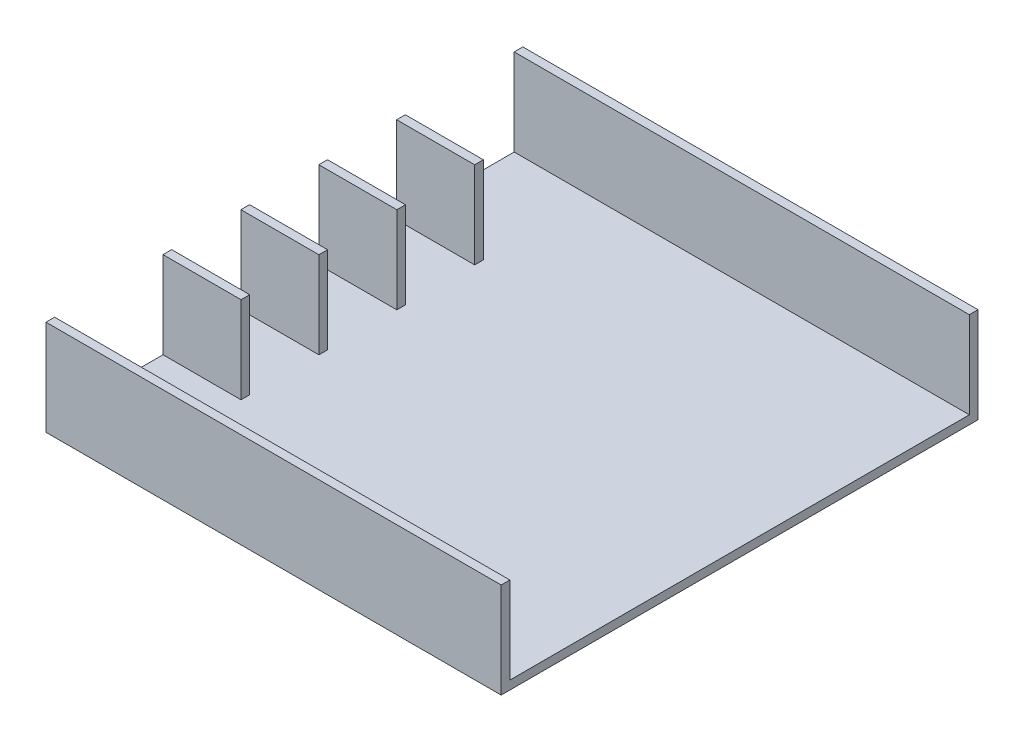
ISO-10303-21;
HEADER;
FILE_DESCRIPTION(('STEP AP214'),'2;1');
FILE_NAME('part.step','',(''),(''),'','','');
FILE_SCHEMA(('AUTOMOTIVE_DESIGN { 1 0 10303 214 1 1 1 1 }'));
ENDSEC;
DATA;
#1=APPLICATION_CONTEXT('core data for automotive mechanical design processes');
#2=APPLICATION_PROTOCOL_DEFINITION('international standard','automotive_design',2000,#1);
#3=PRODUCT_CONTEXT('',#1,'mechanical');
#4=PRODUCT('Part','Part','',(#3));
#5=PRODUCT_RELATED_PRODUCT_CATEGORY('part','',(#4));
#6=PRODUCT_DEFINITION_FORMATION('','',#4);
#7=PRODUCT_DEFINITION_CONTEXT('part definition',#1,'design');
#8=PRODUCT_DEFINITION('design','',#6,#7);
#9=PRODUCT_DEFINITION_SHAPE('','',#8);
#10=(LENGTH_UNIT() NAMED_UNIT(*) SI_UNIT(.MILLI.,.METRE.));
#11=(NAMED_UNIT(*) PLANE_ANGLE_UNIT() SI_UNIT($,.RADIAN.));
#12=(NAMED_UNIT(*) SI_UNIT($,.STERADIAN.) SOLID_ANGLE_UNIT());
#13=UNCERTAINTY_MEASURE_WITH_UNIT(LENGTH_MEASURE(1.E-05),#10,'distance_accuracy_value','');
#14=(GEOMETRIC_REPRESENTATION_CONTEXT(3) GLOBAL_UNCERTAINTY_ASSIGNED_CONTEXT((#13)) GLOBAL_UNIT_ASSIGNED_CONTEXT((#10,
#11,#12)) REPRESENTATION_CONTEXT('',''));
#15=CARTESIAN_POINT('',(0.,0.,0.));
#16=DIRECTION('',(0.,0.,1.));
#17=DIRECTION('',(1.,0.,0.));
#18=AXIS2_PLACEMENT_3D('',#15,#16,#17);
#19=CARTESIAN_POINT('',(0.,2.,0.));
#20=DIRECTION('',(0.,1.,0.));
#21=DIRECTION('',(0.,0.,1.));
#22=AXIS2_PLACEMENT_3D('',#19,#20,#21);
#23=PLANE('',#22);
#24=DIRECTION('',(0.,0.,1.));
#25=VECTOR('',#24,1.);
#26=CARTESIAN_POINT('',(-52.5,2.,-55.));
#27=LINE('',#26,#25);
#28=CARTESIAN_POINT('',(-52.5,2.,28.0063971585958));
#29=VERTEX_POINT('',#28);
#30=CARTESIAN_POINT('',(-52.5,2.,53.));
#31=VERTEX_POINT('',#30);
#32=EDGE_CURVE('E56',#29,#31,#27,.T.);
#33=ORIENTED_EDGE('',*,*,#32,.T.);
#34=DIRECTION('',(-1.,0.,0.));
#35=VECTOR('',#34,1.);
#36=CARTESIAN_POINT('',(-52.5,2.,53.));
#37=LINE('',#36,#35);
#38=CARTESIAN_POINT('',(52.5,2.,53.));
#39=VERTEX_POINT('',#38);
#40=EDGE_CURVE('E51',#39,#31,#37,.T.);
#41=ORIENTED_EDGE('',*,*,#40,.F.);
#42=DIRECTION('',(0.,0.,-1.));
#43=VECTOR('',#42,1.);
#44=CARTESIAN_POINT('',(52.5,2.,-55.));
#45=LINE('',#44,#43);
#46=CARTESIAN_POINT('',(52.5,2.,-53.));
#47=VERTEX_POINT('',#46);
#48=EDGE_CURVE('E372',#39,#47,#45,.T.);
#49=ORIENTED_EDGE('',*,*,#48,.T.);
#50=DIRECTION('',(1.,0.,0.));
#51=VECTOR('',#50,1.);
#52=CARTESIAN_POINT('',(-52.5,2.,-53.));
#53=LINE('',#52,#51);
#54=CARTESIAN_POINT('',(-52.5,2.,-53.));
#55=VERTEX_POINT('',#54);
#56=EDGE_CURVE('E230',#55,#47,#53,.T.);
#57=ORIENTED_EDGE('',*,*,#56,.F.);
#58=CARTESIAN_POINT('',(-52.5,2.,-27.8950708220125));
#59=VERTEX_POINT('',#58);
#60=EDGE_CURVE('E37',#55,#59,#27,.T.);
#61=ORIENTED_EDGE('',*,*,#60,.T.);
#62=DIRECTION('',(-1.,0.,0.));
#63=VECTOR('',#62,1.);
#64=CARTESIAN_POINT('',(-34.5,2.,-27.8950708220125));
#65=LINE('',#64,#63);
#66=CARTESIAN_POINT('',(-34.5,2.,-27.8950708220125));
#67=VERTEX_POINT('',#66);
#68=EDGE_CURVE('E341',#67,#59,#65,.T.);
#69=ORIENTED_EDGE('',*,*,#68,.F.);
#70=DIRECTION('',(0.,0.,-1.));
#71=VECTOR('',#70,1.);
#72=CARTESIAN_POINT('',(-34.5,2.,-25.8950708220125));
#73=LINE('',#72,#71);
#74=CARTESIAN_POINT('',(-34.5,2.,-25.8950708220125));
#75=VERTEX_POINT('',#74);
#76=EDGE_CURVE('E348',#75,#67,#73,.T.);
#77=ORIENTED_EDGE('',*,*,#76,.F.);
#78=DIRECTION('',(1.,0.,0.));
#79=VECTOR('',#78,1.);
#80=CARTESIAN_POINT('',(-34.5,2.,-25.8950708220125));
#81=LINE('',#80,#79);
#82=CARTESIAN_POINT('',(-52.5,2.,-25.8950708220125));
#83=VERTEX_POINT('',#82);
#84=EDGE_CURVE('E336',#83,#75,#81,.T.);
#85=ORIENTED_EDGE('',*,*,#84,.F.);
#86=CARTESIAN_POINT('',(-52.5,2.,-9.93407144789655));
#87=VERTEX_POINT('',#86);
#88=EDGE_CURVE('E367',#83,#87,#27,.T.);
#89=ORIENTED_EDGE('',*,*,#88,.T.);
#90=DIRECTION('',(-1.,0.,0.));
#91=VECTOR('',#90,1.);
#92=CARTESIAN_POINT('',(-34.5,2.,-9.93407144789656));
#93=LINE('',#92,#91);
#94=CARTESIAN_POINT('',(-34.5,2.,-9.93407144789656));
#95=VERTEX_POINT('',#94);
#96=EDGE_CURVE('E315',#95,#87,#93,.T.);
#97=ORIENTED_EDGE('',*,*,#96,.F.);
#98=DIRECTION('',(0.,0.,-1.));
#99=VECTOR('',#98,1.);
#100=CARTESIAN_POINT('',(-34.5,2.,-7.93407144789655));
#101=LINE('',#100,#99);
#102=CARTESIAN_POINT('',(-34.5,2.,-7.93407144789655));
#103=VERTEX_POINT('',#102);
#104=EDGE_CURVE('E323',#103,#95,#101,.T.);
#105=ORIENTED_EDGE('',*,*,#104,.F.);
#106=DIRECTION('',(1.,0.,0.));
#107=VECTOR('',#106,1.);
#108=CARTESIAN_POINT('',(-34.5,2.,-7.93407144789655));
#109=LINE('',#108,#107);
#110=CARTESIAN_POINT('',(-52.5,2.,-7.93407144789655));
#111=VERTEX_POINT('',#110);
#112=EDGE_CURVE('E310',#111,#103,#109,.T.);
#113=ORIENTED_EDGE('',*,*,#112,.F.);
#114=CARTESIAN_POINT('',(-52.5,2.,8.04022418018514));
#115=VERTEX_POINT('',#114);
#116=EDGE_CURVE('E365',#111,#115,#27,.T.);
#117=ORIENTED_EDGE('',*,*,#116,.T.);
#118=DIRECTION('',(-1.,0.,0.));
#119=VECTOR('',#118,1.);
#120=CARTESIAN_POINT('',(-34.5,2.,8.04022418018513));
#121=LINE('',#120,#119);
#122=CARTESIAN_POINT('',(-34.5,2.,8.04022418018513));
#123=VERTEX_POINT('',#122);
#124=EDGE_CURVE('E285',#123,#115,#121,.T.);
#125=ORIENTED_EDGE('',*,*,#124,.F.);
#126=DIRECTION('',(0.,0.,-1.));
#127=VECTOR('',#126,1.);
#128=CARTESIAN_POINT('',(-34.5,2.,10.0402241801851));
#129=LINE('',#128,#127);
#130=CARTESIAN_POINT('',(-34.5,2.,10.0402241801851));
#131=VERTEX_POINT('',#130);
#132=EDGE_CURVE('E294',#131,#123,#129,.T.);
#133=ORIENTED_EDGE('',*,*,#132,.F.);
#134=DIRECTION('',(1.,0.,0.));
#135=VECTOR('',#134,1.);
#136=CARTESIAN_POINT('',(-34.5,2.,10.0402241801851));
#137=LINE('',#136,#135);
#138=CARTESIAN_POINT('',(-52.5,2.,10.0402241801851));
#139=VERTEX_POINT('',#138);
#140=EDGE_CURVE('E280',#139,#131,#137,.T.);
#141=ORIENTED_EDGE('',*,*,#140,.F.);
#142=CARTESIAN_POINT('',(-52.5,2.,26.0063971585958));
#143=VERTEX_POINT('',#142);
#144=EDGE_CURVE('E368',#139,#143,#27,.T.);
#145=ORIENTED_EDGE('',*,*,#144,.T.);
#146=DIRECTION('',(-1.,0.,0.));
#147=VECTOR('',#146,1.);
#148=CARTESIAN_POINT('',(-34.5,2.,26.0063971585958));
#149=LINE('',#148,#147);
#150=CARTESIAN_POINT('',(-34.5,2.,26.0063971585958));
#151=VERTEX_POINT('',#150);
#152=EDGE_CURVE('E255',#151,#143,#149,.T.);
#153=ORIENTED_EDGE('',*,*,#152,.F.);
#154=DIRECTION('',(0.,0.,-1.));
#155=VECTOR('',#154,1.);
#156=CARTESIAN_POINT('',(-34.5,2.,28.0063971585958));
#157=LINE('',#156,#155);
#158=CARTESIAN_POINT('',(-34.5,2.,28.0063971585958));
#159=VERTEX_POINT('',#158);
#160=EDGE_CURVE('E264',#159,#151,#157,.T.);
#161=ORIENTED_EDGE('',*,*,#160,.F.);
#162=DIRECTION('',(1.,0.,0.));
#163=VECTOR('',#162,1.);
#164=CARTESIAN_POINT('',(-34.5,2.,28.0063971585958));
#165=LINE('',#164,#163);
#166=EDGE_CURVE('E250',#29,#159,#165,.T.);
#167=ORIENTED_EDGE('',*,*,#166,.F.);
#168=EDGE_LOOP('',(#33,#41,#49,#57,#61,#69,#77,#85,#89,#97,#105,#113,#117,#125,#133,#141,#145,
#153,#161,#167));
#169=FACE_BOUND('',#168,.T.);
#170=ADVANCED_FACE('F33',(#169),#23,.T.);
#171=CARTESIAN_POINT('',(52.5,2.,-55.));
#172=DIRECTION('',(-1.,0.,0.));
#173=DIRECTION('',(0.,0.,1.));
#174=AXIS2_PLACEMENT_3D('',#171,#172,#173);
#175=PLANE('',#174);
#176=DIRECTION('',(0.,0.,-1.));
#177=VECTOR('',#176,1.);
#178=CARTESIAN_POINT('',(52.5,0.,-55.));
#179=LINE('',#178,#177);
#180=CARTESIAN_POINT('',(52.5,0.,55.));
#181=VERTEX_POINT('',#180);
#182=CARTESIAN_POINT('',(52.5,0.,-55.));
#183=VERTEX_POINT('',#182);
#184=EDGE_CURVE('E373',#181,#183,#179,.T.);
#185=ORIENTED_EDGE('',*,*,#184,.T.);
#186=DIRECTION('',(0.,-1.,0.));
#187=VECTOR('',#186,1.);
#188=CARTESIAN_POINT('',(52.5,2.,-55.));
#189=LINE('',#188,#187);
#190=CARTESIAN_POINT('',(52.5,22.,-55.));
#191=VERTEX_POINT('',#190);
#192=EDGE_CURVE('E11',#191,#183,#189,.T.);
#193=ORIENTED_EDGE('',*,*,#192,.F.);
#194=DIRECTION('',(0.,0.,-1.));
#195=VECTOR('',#194,1.);
#196=CARTESIAN_POINT('',(52.5,22.,-55.));
#197=LINE('',#196,#195);
#198=CARTESIAN_POINT('',(52.5,22.,-53.));
#199=VERTEX_POINT('',#198);
#200=EDGE_CURVE('E236',#199,#191,#197,.T.);
#201=ORIENTED_EDGE('',*,*,#200,.F.);
#202=DIRECTION('',(0.,-1.,0.));
#203=VECTOR('',#202,1.);
#204=CARTESIAN_POINT('',(52.5,22.,-53.));
#205=LINE('',#204,#203);
#206=EDGE_CURVE('E242',#199,#47,#205,.T.);
#207=ORIENTED_EDGE('',*,*,#206,.T.);
#208=ORIENTED_EDGE('',*,*,#48,.F.);
#209=DIRECTION('',(0.,-1.,0.));
#210=VECTOR('',#209,1.);
#211=CARTESIAN_POINT('',(52.5,22.,53.));
#212=LINE('',#211,#210);
#213=CARTESIAN_POINT('',(52.5,22.,53.));
#214=VERTEX_POINT('',#213);
#215=EDGE_CURVE('E227',#214,#39,#212,.T.);
#216=ORIENTED_EDGE('',*,*,#215,.F.);
#217=DIRECTION('',(0.,0.,-1.));
#218=VECTOR('',#217,1.);
#219=CARTESIAN_POINT('',(52.5,22.,55.));
#220=LINE('',#219,#218);
#221=CARTESIAN_POINT('',(52.5,22.,55.));
#222=VERTEX_POINT('',#221);
#223=EDGE_CURVE('E214',#222,#214,#220,.T.);
#224=ORIENTED_EDGE('',*,*,#223,.F.);
#225=DIRECTION('',(0.,-1.,0.));
#226=VECTOR('',#225,1.);
#227=CARTESIAN_POINT('',(52.5,2.,55.));
#228=LINE('',#227,#226);
#229=EDGE_CURVE('E206',#222,#181,#228,.T.);
#230=ORIENTED_EDGE('',*,*,#229,.T.);
#231=EDGE_LOOP('',(#185,#193,#201,#207,#208,#216,#224,#230));
#232=FACE_BOUND('',#231,.T.);
#233=ADVANCED_FACE('F35',(#232),#175,.F.);
#234=CARTESIAN_POINT('',(-52.5,2.,-55.));
#235=DIRECTION('',(0.,0.,1.));
#236=DIRECTION('',(1.,0.,0.));
#237=AXIS2_PLACEMENT_3D('',#234,#235,#236);
#238=PLANE('',#237);
#239=DIRECTION('',(-1.,0.,0.));
#240=VECTOR('',#239,1.);
#241=CARTESIAN_POINT('',(-52.5,0.,-55.));
#242=LINE('',#241,#240);
#243=CARTESIAN_POINT('',(-52.5,0.,-55.));
#244=VERTEX_POINT('',#243);
#245=EDGE_CURVE('E384',#183,#244,#242,.T.);
#246=ORIENTED_EDGE('',*,*,#245,.T.);
#247=DIRECTION('',(0.,-1.,0.));
#248=VECTOR('',#247,1.);
#249=CARTESIAN_POINT('',(-52.5,2.,-55.));
#250=LINE('',#249,#248);
#251=CARTESIAN_POINT('',(-52.5,22.,-55.));
#252=VERTEX_POINT('',#251);
#253=EDGE_CURVE('E43',#252,#244,#250,.T.);
#254=ORIENTED_EDGE('',*,*,#253,.F.);
#255=DIRECTION('',(-1.,0.,0.));
#256=VECTOR('',#255,1.);
#257=CARTESIAN_POINT('',(-52.5,22.,-55.));
#258=LINE('',#257,#256);
#259=EDGE_CURVE('E239',#191,#252,#258,.T.);
#260=ORIENTED_EDGE('',*,*,#259,.F.);
#261=ORIENTED_EDGE('',*,*,#192,.T.);
#262=EDGE_LOOP('',(#246,#254,#260,#261));
#263=FACE_BOUND('',#262,.T.);
#264=ADVANCED_FACE('F439',(#263),#238,.F.);
#265=CARTESIAN_POINT('',(-52.5,2.,-55.));
#266=DIRECTION('',(1.,0.,0.));
#267=DIRECTION('',(0.,0.,-1.));
#268=AXIS2_PLACEMENT_3D('',#265,#266,#267);
#269=PLANE('',#268);
#270=DIRECTION('',(0.,0.,1.));
#271=VECTOR('',#270,1.);
#272=CARTESIAN_POINT('',(-52.5,0.,-55.));
#273=LINE('',#272,#271);
#274=CARTESIAN_POINT('',(-52.5,0.,55.));
#275=VERTEX_POINT('',#274);
#276=EDGE_CURVE('E203',#244,#275,#273,.T.);
#277=ORIENTED_EDGE('',*,*,#276,.T.);
#278=DIRECTION('',(0.,-1.,0.));
#279=VECTOR('',#278,1.);
#280=CARTESIAN_POINT('',(-52.5,2.,55.));
#281=LINE('',#280,#279);
#282=CARTESIAN_POINT('',(-52.5,22.,55.));
#283=VERTEX_POINT('',#282);
#284=EDGE_CURVE('E195',#283,#275,#281,.T.);
#285=ORIENTED_EDGE('',*,*,#284,.F.);
#286=DIRECTION('',(0.,0.,1.));
#287=VECTOR('',#286,1.);
#288=CARTESIAN_POINT('',(-52.5,22.,55.));
#289=LINE('',#288,#287);
#290=CARTESIAN_POINT('',(-52.5,22.,53.));
#291=VERTEX_POINT('',#290);
#292=EDGE_CURVE('E200',#291,#283,#289,.T.);
#293=ORIENTED_EDGE('',*,*,#292,.F.);
#294=DIRECTION('',(0.,-1.,0.));
#295=VECTOR('',#294,1.);
#296=CARTESIAN_POINT('',(-52.5,22.,53.));
#297=LINE('',#296,#295);
#298=EDGE_CURVE('E224',#291,#31,#297,.T.);
#299=ORIENTED_EDGE('',*,*,#298,.T.);
#300=ORIENTED_EDGE('',*,*,#32,.F.);
#301=DIRECTION('',(0.,-1.,0.));
#302=VECTOR('',#301,1.);
#303=CARTESIAN_POINT('',(-52.5,22.,28.0063971585958));
#304=LINE('',#303,#302);
#305=CARTESIAN_POINT('',(-52.5,22.,28.0063971585958));
#306=VERTEX_POINT('',#305);
#307=EDGE_CURVE('E277',#306,#29,#304,.T.);
#308=ORIENTED_EDGE('',*,*,#307,.F.);
#309=DIRECTION('',(0.,0.,1.));
#310=VECTOR('',#309,1.);
#311=CARTESIAN_POINT('',(-52.5,22.,28.0063971585958));
#312=LINE('',#311,#310);
#313=CARTESIAN_POINT('',(-52.5,22.,26.0063971585958));
#314=VERTEX_POINT('',#313);
#315=EDGE_CURVE('E251',#314,#306,#312,.T.);
#316=ORIENTED_EDGE('',*,*,#315,.F.);
#317=DIRECTION('',(0.,-1.,0.));
#318=VECTOR('',#317,1.);
#319=CARTESIAN_POINT('',(-52.5,22.,26.0063971585958));
#320=LINE('',#319,#318);
#321=EDGE_CURVE('E261',#314,#143,#320,.T.);
#322=ORIENTED_EDGE('',*,*,#321,.T.);
#323=ORIENTED_EDGE('',*,*,#144,.F.);
#324=DIRECTION('',(0.,-1.,0.));
#325=VECTOR('',#324,1.);
#326=CARTESIAN_POINT('',(-52.5,22.,10.0402241801851));
#327=LINE('',#326,#325);
#328=CARTESIAN_POINT('',(-52.5,22.,10.0402241801851));
#329=VERTEX_POINT('',#328);
#330=EDGE_CURVE('E307',#329,#139,#327,.T.);
#331=ORIENTED_EDGE('',*,*,#330,.F.);
#332=DIRECTION('',(0.,0.,1.));
#333=VECTOR('',#332,1.);
#334=CARTESIAN_POINT('',(-52.5,22.,10.0402241801851));
#335=LINE('',#334,#333);
#336=CARTESIAN_POINT('',(-52.5,22.,8.04022418018514));
#337=VERTEX_POINT('',#336);
#338=EDGE_CURVE('E281',#337,#329,#335,.T.);
#339=ORIENTED_EDGE('',*,*,#338,.F.);
#340=DIRECTION('',(0.,-1.,0.));
#341=VECTOR('',#340,1.);
#342=CARTESIAN_POINT('',(-52.5,22.,8.04022418018514));
#343=LINE('',#342,#341);
#344=EDGE_CURVE('E291',#337,#115,#343,.T.);
#345=ORIENTED_EDGE('',*,*,#344,.T.);
#346=ORIENTED_EDGE('',*,*,#116,.F.);
#347=DIRECTION('',(0.,-1.,0.));
#348=VECTOR('',#347,1.);
#349=CARTESIAN_POINT('',(-52.5,22.,-7.93407144789655));
#350=LINE('',#349,#348);
#351=CARTESIAN_POINT('',(-52.5,22.,-7.93407144789655));
#352=VERTEX_POINT('',#351);
#353=EDGE_CURVE('E334',#352,#111,#350,.T.);
#354=ORIENTED_EDGE('',*,*,#353,.F.);
#355=DIRECTION('',(0.,0.,1.));
#356=VECTOR('',#355,1.);
#357=CARTESIAN_POINT('',(-52.5,22.,-7.93407144789655));
#358=LINE('',#357,#356);
#359=CARTESIAN_POINT('',(-52.5,22.,-9.93407144789655));
#360=VERTEX_POINT('',#359);
#361=EDGE_CURVE('E311',#360,#352,#358,.T.);
#362=ORIENTED_EDGE('',*,*,#361,.F.);
#363=DIRECTION('',(0.,-1.,0.));
#364=VECTOR('',#363,1.);
#365=CARTESIAN_POINT('',(-52.5,22.,-9.93407144789655));
#366=LINE('',#365,#364);
#367=EDGE_CURVE('E321',#360,#87,#366,.T.);
#368=ORIENTED_EDGE('',*,*,#367,.T.);
#369=ORIENTED_EDGE('',*,*,#88,.F.);
#370=DIRECTION('',(0.,-1.,0.));
#371=VECTOR('',#370,1.);
#372=CARTESIAN_POINT('',(-52.5,22.,-25.8950708220125));
#373=LINE('',#372,#371);
#374=CARTESIAN_POINT('',(-52.5,22.,-25.8950708220125));
#375=VERTEX_POINT('',#374);
#376=EDGE_CURVE('E397',#375,#83,#373,.T.);
#377=ORIENTED_EDGE('',*,*,#376,.F.);
#378=DIRECTION('',(0.,0.,1.));
#379=VECTOR('',#378,1.);
#380=CARTESIAN_POINT('',(-52.5,22.,-25.8950708220125));
#381=LINE('',#380,#379);
#382=CARTESIAN_POINT('',(-52.5,22.,-27.8950708220125));
#383=VERTEX_POINT('',#382);
#384=EDGE_CURVE('E337',#383,#375,#381,.T.);
#385=ORIENTED_EDGE('',*,*,#384,.F.);
#386=DIRECTION('',(0.,-1.,0.));
#387=VECTOR('',#386,1.);
#388=CARTESIAN_POINT('',(-52.5,22.,-27.8950708220125));
#389=LINE('',#388,#387);
#390=EDGE_CURVE('E347',#383,#59,#389,.T.);
#391=ORIENTED_EDGE('',*,*,#390,.T.);
#392=ORIENTED_EDGE('',*,*,#60,.F.);
#393=DIRECTION('',(0.,-1.,0.));
#394=VECTOR('',#393,1.);
#395=CARTESIAN_POINT('',(-52.5,22.,-53.));
#396=LINE('',#395,#394);
#397=CARTESIAN_POINT('',(-52.5,22.,-53.));
#398=VERTEX_POINT('',#397);
#399=EDGE_CURVE('E247',#398,#55,#396,.T.);
#400=ORIENTED_EDGE('',*,*,#399,.F.);
#401=DIRECTION('',(0.,0.,1.));
#402=VECTOR('',#401,1.);
#403=CARTESIAN_POINT('',(-52.5,22.,-55.));
#404=LINE('',#403,#402);
#405=EDGE_CURVE('E231',#252,#398,#404,.T.);
#406=ORIENTED_EDGE('',*,*,#405,.F.);
#407=ORIENTED_EDGE('',*,*,#253,.T.);
#408=EDGE_LOOP('',(#277,#285,#293,#299,#300,#308,#316,#322,#323,#331,#339,#345,#346,#354,#362,
#368,#369,#377,#385,#391,#392,#400,#406,#407));
#409=FACE_BOUND('',#408,.T.);
#410=ADVANCED_FACE('F197',(#409),#269,.F.);
#411=CARTESIAN_POINT('',(-52.5,2.,55.));
#412=DIRECTION('',(0.,0.,-1.));
#413=DIRECTION('',(-1.,0.,0.));
#414=AXIS2_PLACEMENT_3D('',#411,#412,#413);
#415=PLANE('',#414);
#416=DIRECTION('',(1.,0.,0.));
#417=VECTOR('',#416,1.);
#418=CARTESIAN_POINT('',(-52.5,0.,55.));
#419=LINE('',#418,#417);
#420=EDGE_CURVE('E381',#275,#181,#419,.T.);
#421=ORIENTED_EDGE('',*,*,#420,.T.);
#422=ORIENTED_EDGE('',*,*,#229,.F.);
#423=DIRECTION('',(1.,0.,0.));
#424=VECTOR('',#423,1.);
#425=CARTESIAN_POINT('',(-52.5,22.,55.));
#426=LINE('',#425,#424);
#427=EDGE_CURVE('E209',#283,#222,#426,.T.);
#428=ORIENTED_EDGE('',*,*,#427,.F.);
#429=ORIENTED_EDGE('',*,*,#284,.T.);
#430=EDGE_LOOP('',(#421,#422,#428,#429));
#431=FACE_BOUND('',#430,.T.);
#432=ADVANCED_FACE('F210',(#431),#415,.F.);
#433=CARTESIAN_POINT('',(0.,0.,0.));
#434=DIRECTION('',(0.,1.,0.));
#435=DIRECTION('',(0.,0.,1.));
#436=AXIS2_PLACEMENT_3D('',#433,#434,#435);
#437=PLANE('',#436);
#438=ORIENTED_EDGE('',*,*,#184,.F.);
#439=ORIENTED_EDGE('',*,*,#420,.F.);
#440=ORIENTED_EDGE('',*,*,#276,.F.);
#441=ORIENTED_EDGE('',*,*,#245,.F.);
#442=EDGE_LOOP('',(#438,#439,#440,#441));
#443=FACE_BOUND('',#442,.T.);
#444=ADVANCED_FACE('F394',(#443),#437,.F.);
#445=CARTESIAN_POINT('',(-34.5,22.,-25.8950708220125));
#446=DIRECTION('',(0.,0.,-1.));
#447=DIRECTION('',(-1.,0.,0.));
#448=AXIS2_PLACEMENT_3D('',#445,#446,#447);
#449=PLANE('',#448);
#450=ORIENTED_EDGE('',*,*,#84,.T.);
#451=DIRECTION('',(0.,-1.,0.));
#452=VECTOR('',#451,1.);
#453=CARTESIAN_POINT('',(-34.5,22.,-25.8950708220125));
#454=LINE('',#453,#452);
#455=CARTESIAN_POINT('',(-34.5,22.,-25.8950708220125));
#456=VERTEX_POINT('',#455);
#457=EDGE_CURVE('E399',#456,#75,#454,.T.);
#458=ORIENTED_EDGE('',*,*,#457,.F.);
#459=DIRECTION('',(1.,0.,0.));
#460=VECTOR('',#459,1.);
#461=CARTESIAN_POINT('',(-34.5,22.,-25.8950708220125));
#462=LINE('',#461,#460);
#463=EDGE_CURVE('E340',#375,#456,#462,.T.);
#464=ORIENTED_EDGE('',*,*,#463,.F.);
#465=ORIENTED_EDGE('',*,*,#376,.T.);
#466=EDGE_LOOP('',(#450,#458,#464,#465));
#467=FACE_BOUND('',#466,.T.);
#468=ADVANCED_FACE('F407',(#467),#449,.F.);
#469=CARTESIAN_POINT('',(-34.5,22.,-25.8950708220125));
#470=DIRECTION('',(-1.,0.,0.));
#471=DIRECTION('',(0.,0.,1.));
#472=AXIS2_PLACEMENT_3D('',#469,#470,#471);
#473=PLANE('',#472);
#474=ORIENTED_EDGE('',*,*,#76,.T.);
#475=DIRECTION('',(0.,-1.,0.));
#476=VECTOR('',#475,1.);
#477=CARTESIAN_POINT('',(-34.5,22.,-27.8950708220125));
#478=LINE('',#477,#476);
#479=CARTESIAN_POINT('',(-34.5,22.,-27.8950708220125));
#480=VERTEX_POINT('',#479);
#481=EDGE_CURVE('E353',#480,#67,#478,.T.);
#482=ORIENTED_EDGE('',*,*,#481,.F.);
#483=DIRECTION('',(0.,0.,-1.));
#484=VECTOR('',#483,1.);
#485=CARTESIAN_POINT('',(-34.5,22.,-25.8950708220125));
#486=LINE('',#485,#484);
#487=EDGE_CURVE('E343',#456,#480,#486,.T.);
#488=ORIENTED_EDGE('',*,*,#487,.F.);
#489=ORIENTED_EDGE('',*,*,#457,.T.);
#490=EDGE_LOOP('',(#474,#482,#488,#489));
#491=FACE_BOUND('',#490,.T.);
#492=ADVANCED_FACE('F412',(#491),#473,.F.);
#493=CARTESIAN_POINT('',(-34.5,22.,-27.8950708220125));
#494=DIRECTION('',(0.,0.,1.));
#495=DIRECTION('',(1.,0.,0.));
#496=AXIS2_PLACEMENT_3D('',#493,#494,#495);
#497=PLANE('',#496);
#498=ORIENTED_EDGE('',*,*,#68,.T.);
#499=ORIENTED_EDGE('',*,*,#390,.F.);
#500=DIRECTION('',(-1.,0.,0.));
#501=VECTOR('',#500,1.);
#502=CARTESIAN_POINT('',(-34.5,22.,-27.8950708220125));
#503=LINE('',#502,#501);
#504=EDGE_CURVE('E345',#480,#383,#503,.T.);
#505=ORIENTED_EDGE('',*,*,#504,.F.);
#506=ORIENTED_EDGE('',*,*,#481,.T.);
#507=EDGE_LOOP('',(#498,#499,#505,#506));
#508=FACE_BOUND('',#507,.T.);
#509=ADVANCED_FACE('F424',(#508),#497,.F.);
#510=CARTESIAN_POINT('',(0.,22.,0.));
#511=DIRECTION('',(0.,1.,0.));
#512=DIRECTION('',(0.,0.,1.));
#513=AXIS2_PLACEMENT_3D('',#510,#511,#512);
#514=PLANE('',#513);
#515=ORIENTED_EDGE('',*,*,#384,.T.);
#516=ORIENTED_EDGE('',*,*,#463,.T.);
#517=ORIENTED_EDGE('',*,*,#487,.T.);
#518=ORIENTED_EDGE('',*,*,#504,.T.);
#519=EDGE_LOOP('',(#515,#516,#517,#518));
#520=FACE_BOUND('',#519,.T.);
#521=ADVANCED_FACE('F417',(#520),#514,.T.);
#522=CARTESIAN_POINT('',(-34.5,22.,-7.93407144789655));
#523=DIRECTION('',(0.,0.,-1.));
#524=DIRECTION('',(-1.,0.,0.));
#525=AXIS2_PLACEMENT_3D('',#522,#523,#524);
#526=PLANE('',#525);
#527=ORIENTED_EDGE('',*,*,#112,.T.);
#528=DIRECTION('',(0.,-1.,0.));
#529=VECTOR('',#528,1.);
#530=CARTESIAN_POINT('',(-34.5,22.,-7.93407144789655));
#531=LINE('',#530,#529);
#532=CARTESIAN_POINT('',(-34.5,22.,-7.93407144789655));
#533=VERTEX_POINT('',#532);
#534=EDGE_CURVE('E331',#533,#103,#531,.T.);
#535=ORIENTED_EDGE('',*,*,#534,.F.);
#536=DIRECTION('',(1.,0.,0.));
#537=VECTOR('',#536,1.);
#538=CARTESIAN_POINT('',(-34.5,22.,-7.93407144789655));
#539=LINE('',#538,#537);
#540=EDGE_CURVE('E314',#352,#533,#539,.T.);
#541=ORIENTED_EDGE('',*,*,#540,.F.);
#542=ORIENTED_EDGE('',*,*,#353,.T.);
#543=EDGE_LOOP('',(#527,#535,#541,#542));
#544=FACE_BOUND('',#543,.T.);
#545=ADVANCED_FACE('F431',(#544),#526,.F.);
#546=CARTESIAN_POINT('',(-34.5,22.,-7.93407144789655));
#547=DIRECTION('',(-1.,0.,0.));
#548=DIRECTION('',(0.,0.,1.));
#549=AXIS2_PLACEMENT_3D('',#546,#547,#548);
#550=PLANE('',#549);
#551=ORIENTED_EDGE('',*,*,#104,.T.);
#552=DIRECTION('',(0.,-1.,0.));
#553=VECTOR('',#552,1.);
#554=CARTESIAN_POINT('',(-34.5,22.,-9.93407144789656));
#555=LINE('',#554,#553);
#556=CARTESIAN_POINT('',(-34.5,22.,-9.93407144789656));
#557=VERTEX_POINT('',#556);
#558=EDGE_CURVE('E329',#557,#95,#555,.T.);
#559=ORIENTED_EDGE('',*,*,#558,.F.);
#560=DIRECTION('',(0.,0.,-1.));
#561=VECTOR('',#560,1.);
#562=CARTESIAN_POINT('',(-34.5,22.,-7.93407144789655));
#563=LINE('',#562,#561);
#564=EDGE_CURVE('E317',#533,#557,#563,.T.);
#565=ORIENTED_EDGE('',*,*,#564,.F.);
#566=ORIENTED_EDGE('',*,*,#534,.T.);
#567=EDGE_LOOP('',(#551,#559,#565,#566));
#568=FACE_BOUND('',#567,.T.);
#569=ADVANCED_FACE('F509',(#568),#550,.F.);
#570=CARTESIAN_POINT('',(-34.5,22.,-9.93407144789656));
#571=DIRECTION('',(0.,0.,1.));
#572=DIRECTION('',(1.,0.,0.));
#573=AXIS2_PLACEMENT_3D('',#570,#571,#572);
#574=PLANE('',#573);
#575=ORIENTED_EDGE('',*,*,#96,.T.);
#576=ORIENTED_EDGE('',*,*,#367,.F.);
#577=DIRECTION('',(-1.,0.,0.));
#578=VECTOR('',#577,1.);
#579=CARTESIAN_POINT('',(-34.5,22.,-9.93407144789656));
#580=LINE('',#579,#578);
#581=EDGE_CURVE('E319',#557,#360,#580,.T.);
#582=ORIENTED_EDGE('',*,*,#581,.F.);
#583=ORIENTED_EDGE('',*,*,#558,.T.);
#584=EDGE_LOOP('',(#575,#576,#582,#583));
#585=FACE_BOUND('',#584,.T.);
#586=ADVANCED_FACE('F505',(#585),#574,.F.);
#587=CARTESIAN_POINT('',(0.,22.,0.));
#588=DIRECTION('',(0.,1.,0.));
#589=DIRECTION('',(0.,0.,1.));
#590=AXIS2_PLACEMENT_3D('',#587,#588,#589);
#591=PLANE('',#590);
#592=ORIENTED_EDGE('',*,*,#361,.T.);
#593=ORIENTED_EDGE('',*,*,#540,.T.);
#594=ORIENTED_EDGE('',*,*,#564,.T.);
#595=ORIENTED_EDGE('',*,*,#581,.T.);
#596=EDGE_LOOP('',(#592,#593,#594,#595));
#597=FACE_BOUND('',#596,.T.);
#598=ADVANCED_FACE('F501',(#597),#591,.T.);
#599=CARTESIAN_POINT('',(-34.5,22.,10.0402241801851));
#600=DIRECTION('',(0.,0.,-1.));
#601=DIRECTION('',(-1.,0.,0.));
#602=AXIS2_PLACEMENT_3D('',#599,#600,#601);
#603=PLANE('',#602);
#604=ORIENTED_EDGE('',*,*,#140,.T.);
#605=DIRECTION('',(0.,-1.,0.));
#606=VECTOR('',#605,1.);
#607=CARTESIAN_POINT('',(-34.5,22.,10.0402241801851));
#608=LINE('',#607,#606);
#609=CARTESIAN_POINT('',(-34.5,22.,10.0402241801851));
#610=VERTEX_POINT('',#609);
#611=EDGE_CURVE('E304',#610,#131,#608,.T.);
#612=ORIENTED_EDGE('',*,*,#611,.F.);
#613=DIRECTION('',(1.,0.,0.));
#614=VECTOR('',#613,1.);
#615=CARTESIAN_POINT('',(-34.5,22.,10.0402241801851));
#616=LINE('',#615,#614);
#617=EDGE_CURVE('E284',#329,#610,#616,.T.);
#618=ORIENTED_EDGE('',*,*,#617,.F.);
#619=ORIENTED_EDGE('',*,*,#330,.T.);
#620=EDGE_LOOP('',(#604,#612,#618,#619));
#621=FACE_BOUND('',#620,.T.);
#622=ADVANCED_FACE('F497',(#621),#603,.F.);
#623=CARTESIAN_POINT('',(-34.5,22.,10.0402241801851));
#624=DIRECTION('',(-1.,0.,0.));
#625=DIRECTION('',(0.,0.,1.));
#626=AXIS2_PLACEMENT_3D('',#623,#624,#625);
#627=PLANE('',#626);
#628=ORIENTED_EDGE('',*,*,#132,.T.);
#629=DIRECTION('',(0.,-1.,0.));
#630=VECTOR('',#629,1.);
#631=CARTESIAN_POINT('',(-34.5,22.,8.04022418018513));
#632=LINE('',#631,#630);
#633=CARTESIAN_POINT('',(-34.5,22.,8.04022418018513));
#634=VERTEX_POINT('',#633);
#635=EDGE_CURVE('E301',#634,#123,#632,.T.);
#636=ORIENTED_EDGE('',*,*,#635,.F.);
#637=DIRECTION('',(0.,0.,-1.));
#638=VECTOR('',#637,1.);
#639=CARTESIAN_POINT('',(-34.5,22.,10.0402241801851));
#640=LINE('',#639,#638);
#641=EDGE_CURVE('E287',#610,#634,#640,.T.);
#642=ORIENTED_EDGE('',*,*,#641,.F.);
#643=ORIENTED_EDGE('',*,*,#611,.T.);
#644=EDGE_LOOP('',(#628,#636,#642,#643));
#645=FACE_BOUND('',#644,.T.);
#646=ADVANCED_FACE('F493',(#645),#627,.F.);
#647=CARTESIAN_POINT('',(-34.5,22.,8.04022418018513));
#648=DIRECTION('',(0.,0.,1.));
#649=DIRECTION('',(1.,0.,0.));
#650=AXIS2_PLACEMENT_3D('',#647,#648,#649);
#651=PLANE('',#650);
#652=ORIENTED_EDGE('',*,*,#124,.T.);
#653=ORIENTED_EDGE('',*,*,#344,.F.);
#654=DIRECTION('',(-1.,0.,0.));
#655=VECTOR('',#654,1.);
#656=CARTESIAN_POINT('',(-34.5,22.,8.04022418018513));
#657=LINE('',#656,#655);
#658=EDGE_CURVE('E289',#634,#337,#657,.T.);
#659=ORIENTED_EDGE('',*,*,#658,.F.);
#660=ORIENTED_EDGE('',*,*,#635,.T.);
#661=EDGE_LOOP('',(#652,#653,#659,#660));
#662=FACE_BOUND('',#661,.T.);
#663=ADVANCED_FACE('F489',(#662),#651,.F.);
#664=CARTESIAN_POINT('',(0.,22.,0.));
#665=DIRECTION('',(0.,1.,0.));
#666=DIRECTION('',(0.,0.,1.));
#667=AXIS2_PLACEMENT_3D('',#664,#665,#666);
#668=PLANE('',#667);
#669=ORIENTED_EDGE('',*,*,#338,.T.);
#670=ORIENTED_EDGE('',*,*,#617,.T.);
#671=ORIENTED_EDGE('',*,*,#641,.T.);
#672=ORIENTED_EDGE('',*,*,#658,.T.);
#673=EDGE_LOOP('',(#669,#670,#671,#672));
#674=FACE_BOUND('',#673,.T.);
#675=ADVANCED_FACE('F483',(#674),#668,.T.);
#676=CARTESIAN_POINT('',(-34.5,22.,28.0063971585958));
#677=DIRECTION('',(0.,0.,-1.));
#678=DIRECTION('',(-1.,0.,0.));
#679=AXIS2_PLACEMENT_3D('',#676,#677,#678);
#680=PLANE('',#679);
#681=ORIENTED_EDGE('',*,*,#166,.T.);
#682=DIRECTION('',(0.,-1.,0.));
#683=VECTOR('',#682,1.);
#684=CARTESIAN_POINT('',(-34.5,22.,28.0063971585958));
#685=LINE('',#684,#683);
#686=CARTESIAN_POINT('',(-34.5,22.,28.0063971585958));
#687=VERTEX_POINT('',#686);
#688=EDGE_CURVE('E274',#687,#159,#685,.T.);
#689=ORIENTED_EDGE('',*,*,#688,.F.);
#690=DIRECTION('',(1.,0.,0.));
#691=VECTOR('',#690,1.);
#692=CARTESIAN_POINT('',(-34.5,22.,28.0063971585958));
#693=LINE('',#692,#691);
#694=EDGE_CURVE('E254',#306,#687,#693,.T.);
#695=ORIENTED_EDGE('',*,*,#694,.F.);
#696=ORIENTED_EDGE('',*,*,#307,.T.);
#697=EDGE_LOOP('',(#681,#689,#695,#696));
#698=FACE_BOUND('',#697,.T.);
#699=ADVANCED_FACE('F463',(#698),#680,.F.);
#700=CARTESIAN_POINT('',(-34.5,22.,28.0063971585958));
#701=DIRECTION('',(-1.,0.,0.));
#702=DIRECTION('',(0.,0.,1.));
#703=AXIS2_PLACEMENT_3D('',#700,#701,#702);
#704=PLANE('',#703);
#705=ORIENTED_EDGE('',*,*,#160,.T.);
#706=DIRECTION('',(0.,-1.,0.));
#707=VECTOR('',#706,1.);
#708=CARTESIAN_POINT('',(-34.5,22.,26.0063971585958));
#709=LINE('',#708,#707);
#710=CARTESIAN_POINT('',(-34.5,22.,26.0063971585958));
#711=VERTEX_POINT('',#710);
#712=EDGE_CURVE('E271',#711,#151,#709,.T.);
#713=ORIENTED_EDGE('',*,*,#712,.F.);
#714=DIRECTION('',(0.,0.,-1.));
#715=VECTOR('',#714,1.);
#716=CARTESIAN_POINT('',(-34.5,22.,28.0063971585958));
#717=LINE('',#716,#715);
#718=EDGE_CURVE('E257',#687,#711,#717,.T.);
#719=ORIENTED_EDGE('',*,*,#718,.F.);
#720=ORIENTED_EDGE('',*,*,#688,.T.);
#721=EDGE_LOOP('',(#705,#713,#719,#720));
#722=FACE_BOUND('',#721,.T.);
#723=ADVANCED_FACE('F475',(#722),#704,.F.);
#724=CARTESIAN_POINT('',(-34.5,22.,26.0063971585958));
#725=DIRECTION('',(0.,0.,1.));
#726=DIRECTION('',(1.,0.,0.));
#727=AXIS2_PLACEMENT_3D('',#724,#725,#726);
#728=PLANE('',#727);
#729=ORIENTED_EDGE('',*,*,#152,.T.);
#730=ORIENTED_EDGE('',*,*,#321,.F.);
#731=DIRECTION('',(-1.,0.,0.));
#732=VECTOR('',#731,1.);
#733=CARTESIAN_POINT('',(-34.5,22.,26.0063971585958));
#734=LINE('',#733,#732);
#735=EDGE_CURVE('E259',#711,#314,#734,.T.);
#736=ORIENTED_EDGE('',*,*,#735,.F.);
#737=ORIENTED_EDGE('',*,*,#712,.T.);
#738=EDGE_LOOP('',(#729,#730,#736,#737));
#739=FACE_BOUND('',#738,.T.);
#740=ADVANCED_FACE('F472',(#739),#728,.F.);
#741=CARTESIAN_POINT('',(0.,22.,0.));
#742=DIRECTION('',(0.,1.,0.));
#743=DIRECTION('',(0.,0.,1.));
#744=AXIS2_PLACEMENT_3D('',#741,#742,#743);
#745=PLANE('',#744);
#746=ORIENTED_EDGE('',*,*,#315,.T.);
#747=ORIENTED_EDGE('',*,*,#694,.T.);
#748=ORIENTED_EDGE('',*,*,#718,.T.);
#749=ORIENTED_EDGE('',*,*,#735,.T.);
#750=EDGE_LOOP('',(#746,#747,#748,#749));
#751=FACE_BOUND('',#750,.T.);
#752=ADVANCED_FACE('F466',(#751),#745,.T.);
#753=CARTESIAN_POINT('',(-52.5,22.,-53.));
#754=DIRECTION('',(0.,0.,-1.));
#755=DIRECTION('',(-1.,0.,0.));
#756=AXIS2_PLACEMENT_3D('',#753,#754,#755);
#757=PLANE('',#756);
#758=ORIENTED_EDGE('',*,*,#56,.T.);
#759=ORIENTED_EDGE('',*,*,#206,.F.);
#760=DIRECTION('',(1.,0.,0.));
#761=VECTOR('',#760,1.);
#762=CARTESIAN_POINT('',(-52.5,22.,-53.));
#763=LINE('',#762,#761);
#764=EDGE_CURVE('E234',#398,#199,#763,.T.);
#765=ORIENTED_EDGE('',*,*,#764,.F.);
#766=ORIENTED_EDGE('',*,*,#399,.T.);
#767=EDGE_LOOP('',(#758,#759,#765,#766));
#768=FACE_BOUND('',#767,.T.);
#769=ADVANCED_FACE('F455',(#768),#757,.F.);
#770=CARTESIAN_POINT('',(0.,22.,0.));
#771=DIRECTION('',(0.,1.,0.));
#772=DIRECTION('',(0.,0.,1.));
#773=AXIS2_PLACEMENT_3D('',#770,#771,#772);
#774=PLANE('',#773);
#775=ORIENTED_EDGE('',*,*,#405,.T.);
#776=ORIENTED_EDGE('',*,*,#764,.T.);
#777=ORIENTED_EDGE('',*,*,#200,.T.);
#778=ORIENTED_EDGE('',*,*,#259,.T.);
#779=EDGE_LOOP('',(#775,#776,#777,#778));
#780=FACE_BOUND('',#779,.T.);
#781=ADVANCED_FACE('F452',(#780),#774,.T.);
#782=CARTESIAN_POINT('',(-52.5,22.,53.));
#783=DIRECTION('',(0.,0.,1.));
#784=DIRECTION('',(1.,0.,0.));
#785=AXIS2_PLACEMENT_3D('',#782,#783,#784);
#786=PLANE('',#785);
#787=ORIENTED_EDGE('',*,*,#40,.T.);
#788=ORIENTED_EDGE('',*,*,#298,.F.);
#789=DIRECTION('',(-1.,0.,0.));
#790=VECTOR('',#789,1.);
#791=CARTESIAN_POINT('',(-52.5,22.,53.));
#792=LINE('',#791,#790);
#793=EDGE_CURVE('E218',#214,#291,#792,.T.);
#794=ORIENTED_EDGE('',*,*,#793,.F.);
#795=ORIENTED_EDGE('',*,*,#215,.T.);
#796=EDGE_LOOP('',(#787,#788,#794,#795));
#797=FACE_BOUND('',#796,.T.);
#798=ADVANCED_FACE('F458',(#797),#786,.F.);
#799=CARTESIAN_POINT('',(0.,22.,0.));
#800=DIRECTION('',(0.,-1.,0.));
#801=DIRECTION('',(0.,0.,-1.));
#802=AXIS2_PLACEMENT_3D('',#799,#800,#801);
#803=PLANE('',#802);
#804=ORIENTED_EDGE('',*,*,#292,.T.);
#805=ORIENTED_EDGE('',*,*,#427,.T.);
#806=ORIENTED_EDGE('',*,*,#223,.T.);
#807=ORIENTED_EDGE('',*,*,#793,.T.);
#808=EDGE_LOOP('',(#804,#805,#806,#807));
#809=FACE_BOUND('',#808,.T.);
#810=ADVANCED_FACE('F216',(#809),#803,.F.);
#811=CLOSED_SHELL('',(#170,#233,#264,#410,#432,#444,#468,#492,#509,#521,#545,#569,#586,#598,
#622,#646,#663,#675,#699,#723,#740,#752,#769,#781,#798,#810));
#812=MANIFOLD_SOLID_BREP('B2',#811);
#813=ADVANCED_BREP_SHAPE_REPRESENTATION('',(#18,#812),#14);
#814=SHAPE_DEFINITION_REPRESENTATION(#9,#813);
ENDSEC;
END-ISO-10303-21;
